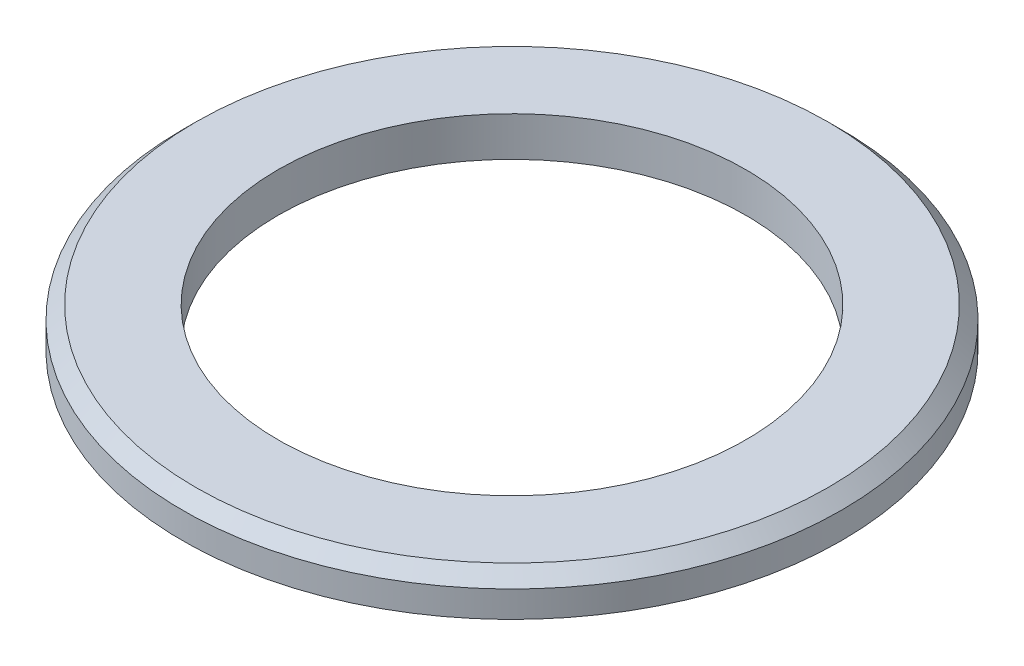
ISO-10303-21;
HEADER;
FILE_DESCRIPTION(('STEP AP214'),'2;1');
FILE_NAME('part.step','',(''),(''),'','','');
FILE_SCHEMA(('AUTOMOTIVE_DESIGN { 1 0 10303 214 1 1 1 1 }'));
ENDSEC;
DATA;
#1=APPLICATION_CONTEXT('core data for automotive mechanical design processes');
#2=APPLICATION_PROTOCOL_DEFINITION('international standard','automotive_design',2000,#1);
#3=PRODUCT_CONTEXT('',#1,'mechanical');
#4=PRODUCT('Part','Part','',(#3));
#5=PRODUCT_RELATED_PRODUCT_CATEGORY('part','',(#4));
#6=PRODUCT_DEFINITION_FORMATION('','',#4);
#7=PRODUCT_DEFINITION_CONTEXT('part definition',#1,'design');
#8=PRODUCT_DEFINITION('design','',#6,#7);
#9=PRODUCT_DEFINITION_SHAPE('','',#8);
#10=(LENGTH_UNIT() NAMED_UNIT(*) SI_UNIT(.MILLI.,.METRE.));
#11=(NAMED_UNIT(*) PLANE_ANGLE_UNIT() SI_UNIT($,.RADIAN.));
#12=(NAMED_UNIT(*) SI_UNIT($,.STERADIAN.) SOLID_ANGLE_UNIT());
#13=UNCERTAINTY_MEASURE_WITH_UNIT(LENGTH_MEASURE(1.E-05),#10,'distance_accuracy_value','');
#14=(GEOMETRIC_REPRESENTATION_CONTEXT(3) GLOBAL_UNCERTAINTY_ASSIGNED_CONTEXT((#13)) GLOBAL_UNIT_ASSIGNED_CONTEXT((#10,
#11,#12)) REPRESENTATION_CONTEXT('',''));
#15=CARTESIAN_POINT('',(0.,0.,0.));
#16=DIRECTION('',(0.,0.,1.));
#17=DIRECTION('',(1.,0.,0.));
#18=AXIS2_PLACEMENT_3D('',#15,#16,#17);
#19=CARTESIAN_POINT('',(0.,0.,0.));
#20=DIRECTION('',(0.,-1.,0.));
#21=DIRECTION('',(1.,0.,0.));
#22=AXIS2_PLACEMENT_3D('',#19,#20,#21);
#23=PLANE('',#22);
#24=CARTESIAN_POINT('',(25.,0.,0.));
#25=DIRECTION('',(0.,1.,0.));
#26=DIRECTION('',(-1.,0.,0.));
#27=AXIS2_PLACEMENT_3D('',#24,#25,#26);
#28=CIRCLE('',#27,17.75);
#29=CARTESIAN_POINT('',(7.25000000000002,0.,0.));
#30=VERTEX_POINT('',#29);
#31=EDGE_CURVE('E45',#30,#30,#28,.T.);
#32=ORIENTED_EDGE('',*,*,#31,.T.);
#33=EDGE_LOOP('',(#32));
#34=FACE_BOUND('',#33,.T.);
#35=CARTESIAN_POINT('',(25.,1.73472347597681E-13,0.));
#36=DIRECTION('',(0.,1.,0.));
#37=DIRECTION('',(-1.,0.,0.));
#38=AXIS2_PLACEMENT_3D('',#35,#36,#37);
#39=CIRCLE('',#38,25.);
#40=CARTESIAN_POINT('',(0.,0.,0.));
#41=VERTEX_POINT('',#40);
#42=EDGE_CURVE('E41',#41,#41,#39,.T.);
#43=ORIENTED_EDGE('',*,*,#42,.F.);
#44=EDGE_LOOP('',(#43));
#45=FACE_BOUND('',#44,.T.);
#46=ADVANCED_FACE('F30',(#34,#45),#23,.T.);
#47=CARTESIAN_POINT('',(25.,3.,0.));
#48=DIRECTION('',(0.,1.,0.));
#49=DIRECTION('',(-1.,0.,0.));
#50=AXIS2_PLACEMENT_3D('',#47,#48,#49);
#51=CYLINDRICAL_SURFACE('',#50,25.);
#52=CARTESIAN_POINT('',(25.,2.00000000000012,0.));
#53=DIRECTION('',(0.,1.,0.));
#54=DIRECTION('',(-1.,0.,0.));
#55=AXIS2_PLACEMENT_3D('',#52,#53,#54);
#56=CIRCLE('',#55,25.);
#57=CARTESIAN_POINT('',(0.,1.99999999999995,0.));
#58=VERTEX_POINT('',#57);
#59=EDGE_CURVE('E10',#58,#58,#56,.F.);
#60=ORIENTED_EDGE('',*,*,#59,.T.);
#61=EDGE_LOOP('',(#60));
#62=FACE_BOUND('',#61,.T.);
#63=ORIENTED_EDGE('',*,*,#42,.T.);
#64=EDGE_LOOP('',(#63));
#65=FACE_BOUND('',#64,.T.);
#66=ADVANCED_FACE('F64',(#62,#65),#51,.T.);
#67=CARTESIAN_POINT('',(0.,2.99999999999991,0.));
#68=DIRECTION('',(0.,1.,0.));
#69=DIRECTION('',(-1.,0.,0.));
#70=AXIS2_PLACEMENT_3D('',#67,#68,#69);
#71=PLANE('',#70);
#72=CARTESIAN_POINT('',(25.,3.00000000000009,0.));
#73=DIRECTION('',(0.,1.,0.));
#74=DIRECTION('',(-1.,0.,0.));
#75=AXIS2_PLACEMENT_3D('',#72,#73,#74);
#76=CIRCLE('',#75,24.0000000000001);
#77=CARTESIAN_POINT('',(0.999999999999931,2.99999999999992,0.));
#78=VERTEX_POINT('',#77);
#79=EDGE_CURVE('E37',#78,#78,#76,.T.);
#80=ORIENTED_EDGE('',*,*,#79,.T.);
#81=EDGE_LOOP('',(#80));
#82=FACE_BOUND('',#81,.T.);
#83=CARTESIAN_POINT('',(25.,3.00000000000009,0.));
#84=DIRECTION('',(0.,1.,0.));
#85=DIRECTION('',(-1.,0.,0.));
#86=AXIS2_PLACEMENT_3D('',#83,#84,#85);
#87=CIRCLE('',#86,17.75);
#88=CARTESIAN_POINT('',(7.25,2.99999999999996,0.));
#89=VERTEX_POINT('',#88);
#90=EDGE_CURVE('E48',#89,#89,#87,.T.);
#91=ORIENTED_EDGE('',*,*,#90,.F.);
#92=EDGE_LOOP('',(#91));
#93=FACE_BOUND('',#92,.T.);
#94=ADVANCED_FACE('F59',(#82,#93),#71,.T.);
#95=CARTESIAN_POINT('',(25.,0.,0.));
#96=DIRECTION('',(0.,1.,0.));
#97=DIRECTION('',(-1.,0.,0.));
#98=AXIS2_PLACEMENT_3D('',#95,#96,#97);
#99=CYLINDRICAL_SURFACE('',#98,17.75);
#100=ORIENTED_EDGE('',*,*,#31,.F.);
#101=EDGE_LOOP('',(#100));
#102=FACE_BOUND('',#101,.T.);
#103=ORIENTED_EDGE('',*,*,#90,.T.);
#104=EDGE_LOOP('',(#103));
#105=FACE_BOUND('',#104,.T.);
#106=ADVANCED_FACE('F56',(#102,#105),#99,.F.);
#107=CARTESIAN_POINT('',(25.,3.00000000000009,0.));
#108=DIRECTION('',(0.,-1.,0.));
#109=DIRECTION('',(1.,0.,0.));
#110=AXIS2_PLACEMENT_3D('',#107,#108,#109);
#111=CONICAL_SURFACE('',#110,24.0000000000001,0.785398163397438);
#112=ORIENTED_EDGE('',*,*,#59,.F.);
#113=EDGE_LOOP('',(#112));
#114=FACE_BOUND('',#113,.T.);
#115=ORIENTED_EDGE('',*,*,#79,.F.);
#116=EDGE_LOOP('',(#115));
#117=FACE_BOUND('',#116,.T.);
#118=ADVANCED_FACE('F32',(#114,#117),#111,.T.);
#119=CLOSED_SHELL('',(#46,#66,#94,#106,#118));
#120=MANIFOLD_SOLID_BREP('B2',#119);
#121=ADVANCED_BREP_SHAPE_REPRESENTATION('',(#18,#120),#14);
#122=SHAPE_DEFINITION_REPRESENTATION(#9,#121);
ENDSEC;
END-ISO-10303-21;
